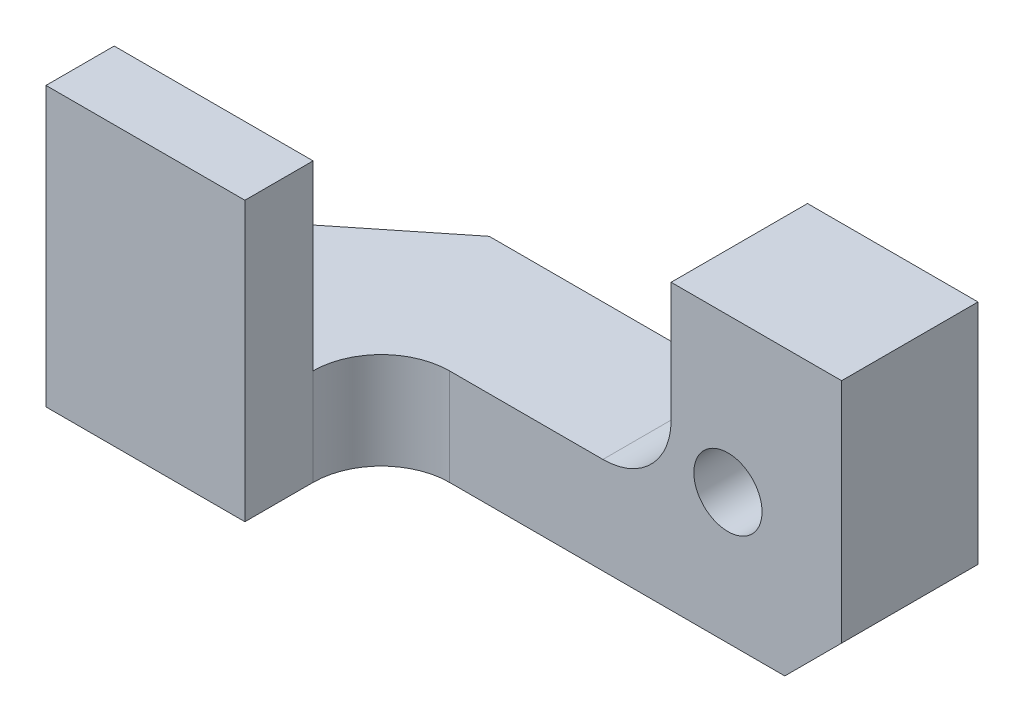
ISO-10303-21;
HEADER;
FILE_DESCRIPTION(('STEP AP214'),'2;1');
FILE_NAME('part.step','',(''),(''),'','','');
FILE_SCHEMA(('AUTOMOTIVE_DESIGN { 1 0 10303 214 1 1 1 1 }'));
ENDSEC;
DATA;
#1=APPLICATION_CONTEXT('core data for automotive mechanical design processes');
#2=APPLICATION_PROTOCOL_DEFINITION('international standard','automotive_design',2000,#1);
#3=PRODUCT_CONTEXT('',#1,'mechanical');
#4=PRODUCT('Part','Part','',(#3));
#5=PRODUCT_RELATED_PRODUCT_CATEGORY('part','',(#4));
#6=PRODUCT_DEFINITION_FORMATION('','',#4);
#7=PRODUCT_DEFINITION_CONTEXT('part definition',#1,'design');
#8=PRODUCT_DEFINITION('design','',#6,#7);
#9=PRODUCT_DEFINITION_SHAPE('','',#8);
#10=(LENGTH_UNIT() NAMED_UNIT(*) SI_UNIT(.MILLI.,.METRE.));
#11=(NAMED_UNIT(*) PLANE_ANGLE_UNIT() SI_UNIT($,.RADIAN.));
#12=(NAMED_UNIT(*) SI_UNIT($,.STERADIAN.) SOLID_ANGLE_UNIT());
#13=UNCERTAINTY_MEASURE_WITH_UNIT(LENGTH_MEASURE(1.E-05),#10,'distance_accuracy_value','');
#14=(GEOMETRIC_REPRESENTATION_CONTEXT(3) GLOBAL_UNCERTAINTY_ASSIGNED_CONTEXT((#13)) GLOBAL_UNIT_ASSIGNED_CONTEXT((#10,
#11,#12)) REPRESENTATION_CONTEXT('',''));
#15=CARTESIAN_POINT('',(0.,0.,0.));
#16=DIRECTION('',(0.,0.,1.));
#17=DIRECTION('',(1.,0.,0.));
#18=AXIS2_PLACEMENT_3D('',#15,#16,#17);
#19=CARTESIAN_POINT('',(7.366,6.35,-3.048));
#20=DIRECTION('',(0.,0.,1.));
#21=DIRECTION('',(1.,0.,0.));
#22=AXIS2_PLACEMENT_3D('',#19,#20,#21);
#23=PLANE('',#22);
#24=CARTESIAN_POINT('',(4.826,2.921,-3.048));
#25=DIRECTION('',(0.,0.,-1.));
#26=DIRECTION('',(-1.,0.,0.));
#27=AXIS2_PLACEMENT_3D('',#24,#25,#26);
#28=CIRCLE('',#27,0.761999999999999);
#29=CARTESIAN_POINT('',(4.064,2.921,-3.048));
#30=VERTEX_POINT('',#29);
#31=EDGE_CURVE('E158',#30,#30,#28,.T.);
#32=ORIENTED_EDGE('',*,*,#31,.F.);
#33=EDGE_LOOP('',(#32));
#34=FACE_BOUND('',#33,.T.);
#35=DIRECTION('',(0.,1.,0.));
#36=VECTOR('',#35,1.);
#37=CARTESIAN_POINT('',(-3.556,0.,-3.048));
#38=LINE('',#37,#36);
#39=CARTESIAN_POINT('',(-3.556,0.,-3.048));
#40=VERTEX_POINT('',#39);
#41=CARTESIAN_POINT('',(-3.556,2.159,-3.048));
#42=VERTEX_POINT('',#41);
#43=EDGE_CURVE('E189',#40,#42,#38,.T.);
#44=ORIENTED_EDGE('',*,*,#43,.T.);
#45=DIRECTION('',(1.,0.,0.));
#46=VECTOR('',#45,1.);
#47=CARTESIAN_POINT('',(0.,2.159,-3.048));
#48=LINE('',#47,#46);
#49=CARTESIAN_POINT('',(2.032,2.159,-3.048));
#50=VERTEX_POINT('',#49);
#51=EDGE_CURVE('E163',#42,#50,#48,.T.);
#52=ORIENTED_EDGE('',*,*,#51,.T.);
#53=CARTESIAN_POINT('',(2.032,3.683,-3.048));
#54=DIRECTION('',(0.,0.,-1.));
#55=DIRECTION('',(-1.,0.,0.));
#56=AXIS2_PLACEMENT_3D('',#53,#54,#55);
#57=CIRCLE('',#56,1.524);
#58=CARTESIAN_POINT('',(3.556,3.683,-3.048));
#59=VERTEX_POINT('',#58);
#60=EDGE_CURVE('E152',#59,#50,#57,.T.);
#61=ORIENTED_EDGE('',*,*,#60,.F.);
#62=DIRECTION('',(0.,1.,0.));
#63=VECTOR('',#62,1.);
#64=CARTESIAN_POINT('',(3.556,3.683,-3.048));
#65=LINE('',#64,#63);
#66=CARTESIAN_POINT('',(3.556,6.35,-3.048));
#67=VERTEX_POINT('',#66);
#68=EDGE_CURVE('E197',#59,#67,#65,.T.);
#69=ORIENTED_EDGE('',*,*,#68,.T.);
#70=DIRECTION('',(-1.,0.,0.));
#71=VECTOR('',#70,1.);
#72=CARTESIAN_POINT('',(7.366,6.35,-3.048));
#73=LINE('',#72,#71);
#74=CARTESIAN_POINT('',(7.366,6.35,-3.048));
#75=VERTEX_POINT('',#74);
#76=EDGE_CURVE('E222',#75,#67,#73,.T.);
#77=ORIENTED_EDGE('',*,*,#76,.F.);
#78=DIRECTION('',(0.,-1.,0.));
#79=VECTOR('',#78,1.);
#80=CARTESIAN_POINT('',(7.366,6.35,-3.048));
#81=LINE('',#80,#79);
#82=CARTESIAN_POINT('',(7.366,1.27,-3.048));
#83=VERTEX_POINT('',#82);
#84=EDGE_CURVE('E226',#75,#83,#81,.T.);
#85=ORIENTED_EDGE('',*,*,#84,.T.);
#86=DIRECTION('',(0.707106781186548,0.707106781186547,0.));
#87=VECTOR('',#86,1.);
#88=CARTESIAN_POINT('',(7.366,1.27,-3.048));
#89=LINE('',#88,#87);
#90=CARTESIAN_POINT('',(6.096,0.,-3.048));
#91=VERTEX_POINT('',#90);
#92=EDGE_CURVE('E173',#91,#83,#89,.T.);
#93=ORIENTED_EDGE('',*,*,#92,.F.);
#94=DIRECTION('',(-1.,0.,0.));
#95=VECTOR('',#94,1.);
#96=CARTESIAN_POINT('',(7.366,0.,-3.048));
#97=LINE('',#96,#95);
#98=EDGE_CURVE('E223',#91,#40,#97,.T.);
#99=ORIENTED_EDGE('',*,*,#98,.T.);
#100=EDGE_LOOP('',(#44,#52,#61,#69,#77,#85,#93,#99));
#101=FACE_BOUND('',#100,.T.);
#102=ADVANCED_FACE('F34',(#34,#101),#23,.F.);
#103=CARTESIAN_POINT('',(-1.397,0.,1.524));
#104=DIRECTION('',(0.,1.,0.));
#105=DIRECTION('',(0.,0.,1.));
#106=AXIS2_PLACEMENT_3D('',#103,#104,#105);
#107=CYLINDRICAL_SURFACE('',#106,1.524);
#108=CARTESIAN_POINT('',(-1.397,2.159,1.524));
#109=DIRECTION('',(0.,1.,0.));
#110=DIRECTION('',(-1.,0.,0.));
#111=AXIS2_PLACEMENT_3D('',#108,#109,#110);
#112=CIRCLE('',#111,1.524);
#113=CARTESIAN_POINT('',(-2.921,2.159,1.524));
#114=VERTEX_POINT('',#113);
#115=CARTESIAN_POINT('',(-1.397,2.159,0.));
#116=VERTEX_POINT('',#115);
#117=EDGE_CURVE('E171',#114,#116,#112,.F.);
#118=ORIENTED_EDGE('',*,*,#117,.F.);
#119=DIRECTION('',(0.,1.,0.));
#120=VECTOR('',#119,1.);
#121=CARTESIAN_POINT('',(-2.921,0.,1.524));
#122=LINE('',#121,#120);
#123=CARTESIAN_POINT('',(-2.921,0.,1.524));
#124=VERTEX_POINT('',#123);
#125=EDGE_CURVE('E58',#124,#114,#122,.T.);
#126=ORIENTED_EDGE('',*,*,#125,.F.);
#127=CARTESIAN_POINT('',(-1.397,0.,1.524));
#128=DIRECTION('',(0.,1.,0.));
#129=DIRECTION('',(0.,0.,1.));
#130=AXIS2_PLACEMENT_3D('',#127,#128,#129);
#131=CIRCLE('',#130,1.524);
#132=CARTESIAN_POINT('',(-1.397,0.,0.));
#133=VERTEX_POINT('',#132);
#134=EDGE_CURVE('E204',#133,#124,#131,.T.);
#135=ORIENTED_EDGE('',*,*,#134,.F.);
#136=DIRECTION('',(0.,1.,0.));
#137=VECTOR('',#136,1.);
#138=CARTESIAN_POINT('',(-1.397,0.,0.));
#139=LINE('',#138,#137);
#140=EDGE_CURVE('E209',#133,#116,#139,.T.);
#141=ORIENTED_EDGE('',*,*,#140,.T.);
#142=EDGE_LOOP('',(#118,#126,#135,#141));
#143=FACE_BOUND('',#142,.T.);
#144=ADVANCED_FACE('F283',(#143),#107,.F.);
#145=CARTESIAN_POINT('',(0.,0.,0.));
#146=DIRECTION('',(0.,0.,-1.));
#147=DIRECTION('',(-1.,0.,0.));
#148=AXIS2_PLACEMENT_3D('',#145,#146,#147);
#149=PLANE('',#148);
#150=CARTESIAN_POINT('',(4.826,2.921,0.));
#151=DIRECTION('',(0.,0.,-1.));
#152=DIRECTION('',(-1.,0.,0.));
#153=AXIS2_PLACEMENT_3D('',#150,#151,#152);
#154=CIRCLE('',#153,0.761999999999999);
#155=CARTESIAN_POINT('',(4.064,2.921,0.));
#156=VERTEX_POINT('',#155);
#157=EDGE_CURVE('E38',#156,#156,#154,.T.);
#158=ORIENTED_EDGE('',*,*,#157,.T.);
#159=EDGE_LOOP('',(#158));
#160=FACE_BOUND('',#159,.T.);
#161=DIRECTION('',(1.,0.,0.));
#162=VECTOR('',#161,1.);
#163=CARTESIAN_POINT('',(0.,2.159,0.));
#164=LINE('',#163,#162);
#165=CARTESIAN_POINT('',(2.032,2.159,0.));
#166=VERTEX_POINT('',#165);
#167=EDGE_CURVE('E43',#116,#166,#164,.T.);
#168=ORIENTED_EDGE('',*,*,#167,.F.);
#169=ORIENTED_EDGE('',*,*,#140,.F.);
#170=DIRECTION('',(-1.,0.,0.));
#171=VECTOR('',#170,1.);
#172=CARTESIAN_POINT('',(0.,0.,0.));
#173=LINE('',#172,#171);
#174=CARTESIAN_POINT('',(6.096,0.,0.));
#175=VERTEX_POINT('',#174);
#176=EDGE_CURVE('E202',#175,#133,#173,.T.);
#177=ORIENTED_EDGE('',*,*,#176,.F.);
#178=DIRECTION('',(0.707106781186548,0.707106781186547,0.));
#179=VECTOR('',#178,1.);
#180=CARTESIAN_POINT('',(3.048,-3.048,0.));
#181=LINE('',#180,#179);
#182=CARTESIAN_POINT('',(7.366,1.27,0.));
#183=VERTEX_POINT('',#182);
#184=EDGE_CURVE('E240',#175,#183,#181,.T.);
#185=ORIENTED_EDGE('',*,*,#184,.T.);
#186=DIRECTION('',(0.,1.,0.));
#187=VECTOR('',#186,1.);
#188=CARTESIAN_POINT('',(7.366,0.,0.));
#189=LINE('',#188,#187);
#190=CARTESIAN_POINT('',(7.366,6.35,0.));
#191=VERTEX_POINT('',#190);
#192=EDGE_CURVE('E212',#183,#191,#189,.T.);
#193=ORIENTED_EDGE('',*,*,#192,.T.);
#194=DIRECTION('',(-1.,0.,0.));
#195=VECTOR('',#194,1.);
#196=CARTESIAN_POINT('',(0.,6.35,0.));
#197=LINE('',#196,#195);
#198=CARTESIAN_POINT('',(3.556,6.35,0.));
#199=VERTEX_POINT('',#198);
#200=EDGE_CURVE('E201',#191,#199,#197,.T.);
#201=ORIENTED_EDGE('',*,*,#200,.T.);
#202=DIRECTION('',(0.,-1.,0.));
#203=VECTOR('',#202,1.);
#204=CARTESIAN_POINT('',(3.556,0.,0.));
#205=LINE('',#204,#203);
#206=CARTESIAN_POINT('',(3.556,3.683,0.));
#207=VERTEX_POINT('',#206);
#208=EDGE_CURVE('E237',#199,#207,#205,.T.);
#209=ORIENTED_EDGE('',*,*,#208,.T.);
#210=CARTESIAN_POINT('',(2.032,3.683,0.));
#211=DIRECTION('',(0.,0.,-1.));
#212=DIRECTION('',(-1.,0.,0.));
#213=AXIS2_PLACEMENT_3D('',#210,#211,#212);
#214=CIRCLE('',#213,1.524);
#215=EDGE_CURVE('E168',#207,#166,#214,.T.);
#216=ORIENTED_EDGE('',*,*,#215,.T.);
#217=EDGE_LOOP('',(#168,#169,#177,#185,#193,#201,#209,#216));
#218=FACE_BOUND('',#217,.T.);
#219=ADVANCED_FACE('F250',(#160,#218),#149,.F.);
#220=CARTESIAN_POINT('',(-7.366,6.35,3.048));
#221=DIRECTION('',(1.,0.,0.));
#222=DIRECTION('',(0.,0.,-1.));
#223=AXIS2_PLACEMENT_3D('',#220,#221,#222);
#224=PLANE('',#223);
#225=DIRECTION('',(0.,-1.,0.));
#226=VECTOR('',#225,1.);
#227=CARTESIAN_POINT('',(-7.366,6.223,1.524));
#228=LINE('',#227,#226);
#229=CARTESIAN_POINT('',(-7.366,6.223,1.524));
#230=VERTEX_POINT('',#229);
#231=CARTESIAN_POINT('',(-7.366,2.159,1.524));
#232=VERTEX_POINT('',#231);
#233=EDGE_CURVE('E135',#230,#232,#228,.T.);
#234=ORIENTED_EDGE('',*,*,#233,.T.);
#235=DIRECTION('',(0.,0.,-1.));
#236=VECTOR('',#235,1.);
#237=CARTESIAN_POINT('',(-7.366,2.159,1.524));
#238=LINE('',#237,#236);
#239=CARTESIAN_POINT('',(-7.366,2.159,0.));
#240=VERTEX_POINT('',#239);
#241=EDGE_CURVE('E138',#232,#240,#238,.T.);
#242=ORIENTED_EDGE('',*,*,#241,.T.);
#243=DIRECTION('',(0.,1.,0.));
#244=VECTOR('',#243,1.);
#245=CARTESIAN_POINT('',(-7.366,0.,0.));
#246=LINE('',#245,#244);
#247=CARTESIAN_POINT('',(-7.366,0.,0.));
#248=VERTEX_POINT('',#247);
#249=EDGE_CURVE('E190',#248,#240,#246,.T.);
#250=ORIENTED_EDGE('',*,*,#249,.F.);
#251=DIRECTION('',(0.,0.,1.));
#252=VECTOR('',#251,1.);
#253=CARTESIAN_POINT('',(-7.366,0.,3.048));
#254=LINE('',#253,#252);
#255=CARTESIAN_POINT('',(-7.366,0.,3.048));
#256=VERTEX_POINT('',#255);
#257=EDGE_CURVE('E214',#248,#256,#254,.T.);
#258=ORIENTED_EDGE('',*,*,#257,.T.);
#259=DIRECTION('',(0.,-1.,0.));
#260=VECTOR('',#259,1.);
#261=CARTESIAN_POINT('',(-7.366,6.35,3.048));
#262=LINE('',#261,#260);
#263=CARTESIAN_POINT('',(-7.366,6.223,3.048));
#264=VERTEX_POINT('',#263);
#265=EDGE_CURVE('E234',#264,#256,#262,.T.);
#266=ORIENTED_EDGE('',*,*,#265,.F.);
#267=DIRECTION('',(0.,0.,1.));
#268=VECTOR('',#267,1.);
#269=CARTESIAN_POINT('',(-7.366,6.223,3.048));
#270=LINE('',#269,#268);
#271=EDGE_CURVE('E141',#230,#264,#270,.T.);
#272=ORIENTED_EDGE('',*,*,#271,.F.);
#273=EDGE_LOOP('',(#234,#242,#250,#258,#266,#272));
#274=FACE_BOUND('',#273,.T.);
#275=ADVANCED_FACE('F36',(#274),#224,.F.);
#276=CARTESIAN_POINT('',(0.,0.,0.));
#277=DIRECTION('',(0.,1.,0.));
#278=DIRECTION('',(0.,0.,1.));
#279=AXIS2_PLACEMENT_3D('',#276,#277,#278);
#280=PLANE('',#279);
#281=ORIENTED_EDGE('',*,*,#98,.F.);
#282=DIRECTION('',(0.,0.,-1.));
#283=VECTOR('',#282,1.);
#284=CARTESIAN_POINT('',(6.096,0.,3.048));
#285=LINE('',#284,#283);
#286=EDGE_CURVE('E175',#175,#91,#285,.T.);
#287=ORIENTED_EDGE('',*,*,#286,.F.);
#288=ORIENTED_EDGE('',*,*,#176,.T.);
#289=ORIENTED_EDGE('',*,*,#134,.T.);
#290=DIRECTION('',(0.,0.,-1.));
#291=VECTOR('',#290,1.);
#292=CARTESIAN_POINT('',(-2.921,0.,0.));
#293=LINE('',#292,#291);
#294=CARTESIAN_POINT('',(-2.921,0.,3.048));
#295=VERTEX_POINT('',#294);
#296=EDGE_CURVE('E207',#295,#124,#293,.T.);
#297=ORIENTED_EDGE('',*,*,#296,.F.);
#298=DIRECTION('',(1.,0.,0.));
#299=VECTOR('',#298,1.);
#300=CARTESIAN_POINT('',(7.366,0.,3.048));
#301=LINE('',#300,#299);
#302=EDGE_CURVE('E228',#256,#295,#301,.T.);
#303=ORIENTED_EDGE('',*,*,#302,.F.);
#304=ORIENTED_EDGE('',*,*,#257,.F.);
#305=DIRECTION('',(-0.78086880944303,0.,0.624695047554424));
#306=VECTOR('',#305,1.);
#307=CARTESIAN_POINT('',(-2.87453658536585,0.,-3.59317073170732));
#308=LINE('',#307,#306);
#309=EDGE_CURVE('E187',#40,#248,#308,.T.);
#310=ORIENTED_EDGE('',*,*,#309,.F.);
#311=EDGE_LOOP('',(#281,#287,#288,#289,#297,#303,#304,#310));
#312=FACE_BOUND('',#311,.T.);
#313=ADVANCED_FACE('F271',(#312),#280,.F.);
#314=CARTESIAN_POINT('',(7.366,6.35,3.048));
#315=DIRECTION('',(0.,0.,-1.));
#316=DIRECTION('',(-1.,0.,0.));
#317=AXIS2_PLACEMENT_3D('',#314,#315,#316);
#318=PLANE('',#317);
#319=DIRECTION('',(0.,1.,0.));
#320=VECTOR('',#319,1.);
#321=CARTESIAN_POINT('',(-2.921,0.,3.048));
#322=LINE('',#321,#320);
#323=CARTESIAN_POINT('',(-2.921,6.223,3.048));
#324=VERTEX_POINT('',#323);
#325=EDGE_CURVE('E215',#295,#324,#322,.T.);
#326=ORIENTED_EDGE('',*,*,#325,.T.);
#327=DIRECTION('',(1.,0.,0.));
#328=VECTOR('',#327,1.);
#329=CARTESIAN_POINT('',(-2.921,6.223,3.048));
#330=LINE('',#329,#328);
#331=EDGE_CURVE('E145',#264,#324,#330,.T.);
#332=ORIENTED_EDGE('',*,*,#331,.F.);
#333=ORIENTED_EDGE('',*,*,#265,.T.);
#334=ORIENTED_EDGE('',*,*,#302,.T.);
#335=EDGE_LOOP('',(#326,#332,#333,#334));
#336=FACE_BOUND('',#335,.T.);
#337=ADVANCED_FACE('F274',(#336),#318,.F.);
#338=CARTESIAN_POINT('',(-2.921,0.,0.));
#339=DIRECTION('',(1.,0.,0.));
#340=DIRECTION('',(0.,0.,-1.));
#341=AXIS2_PLACEMENT_3D('',#338,#339,#340);
#342=PLANE('',#341);
#343=ORIENTED_EDGE('',*,*,#125,.T.);
#344=DIRECTION('',(0.,-1.,0.));
#345=VECTOR('',#344,1.);
#346=CARTESIAN_POINT('',(-2.921,6.223,1.524));
#347=LINE('',#346,#345);
#348=CARTESIAN_POINT('',(-2.921,6.223,1.524));
#349=VERTEX_POINT('',#348);
#350=EDGE_CURVE('E144',#349,#114,#347,.T.);
#351=ORIENTED_EDGE('',*,*,#350,.F.);
#352=DIRECTION('',(0.,0.,-1.));
#353=VECTOR('',#352,1.);
#354=CARTESIAN_POINT('',(-2.921,6.223,3.048));
#355=LINE('',#354,#353);
#356=EDGE_CURVE('E177',#324,#349,#355,.T.);
#357=ORIENTED_EDGE('',*,*,#356,.F.);
#358=ORIENTED_EDGE('',*,*,#325,.F.);
#359=ORIENTED_EDGE('',*,*,#296,.T.);
#360=EDGE_LOOP('',(#343,#351,#357,#358,#359));
#361=FACE_BOUND('',#360,.T.);
#362=ADVANCED_FACE('F280',(#361),#342,.T.);
#363=CARTESIAN_POINT('',(7.366,6.35,3.048));
#364=DIRECTION('',(-1.,0.,0.));
#365=DIRECTION('',(0.,0.,1.));
#366=AXIS2_PLACEMENT_3D('',#363,#364,#365);
#367=PLANE('',#366);
#368=ORIENTED_EDGE('',*,*,#192,.F.);
#369=DIRECTION('',(0.,0.,-1.));
#370=VECTOR('',#369,1.);
#371=CARTESIAN_POINT('',(7.366,1.27,3.048));
#372=LINE('',#371,#370);
#373=EDGE_CURVE('E50',#183,#83,#372,.T.);
#374=ORIENTED_EDGE('',*,*,#373,.T.);
#375=ORIENTED_EDGE('',*,*,#84,.F.);
#376=DIRECTION('',(0.,0.,-1.));
#377=VECTOR('',#376,1.);
#378=CARTESIAN_POINT('',(7.366,6.35,3.048));
#379=LINE('',#378,#377);
#380=EDGE_CURVE('E220',#191,#75,#379,.T.);
#381=ORIENTED_EDGE('',*,*,#380,.F.);
#382=EDGE_LOOP('',(#368,#374,#375,#381));
#383=FACE_BOUND('',#382,.T.);
#384=ADVANCED_FACE('F286',(#383),#367,.F.);
#385=CARTESIAN_POINT('',(0.,6.35,0.));
#386=DIRECTION('',(0.,1.,0.));
#387=DIRECTION('',(0.,0.,1.));
#388=AXIS2_PLACEMENT_3D('',#385,#386,#387);
#389=PLANE('',#388);
#390=DIRECTION('',(0.,0.,-1.));
#391=VECTOR('',#390,1.);
#392=CARTESIAN_POINT('',(3.556,6.35,-3.048));
#393=LINE('',#392,#391);
#394=EDGE_CURVE('E192',#199,#67,#393,.T.);
#395=ORIENTED_EDGE('',*,*,#394,.F.);
#396=ORIENTED_EDGE('',*,*,#200,.F.);
#397=ORIENTED_EDGE('',*,*,#380,.T.);
#398=ORIENTED_EDGE('',*,*,#76,.T.);
#399=EDGE_LOOP('',(#395,#396,#397,#398));
#400=FACE_BOUND('',#399,.T.);
#401=ADVANCED_FACE('F257',(#400),#389,.T.);
#402=CARTESIAN_POINT('',(3.556,3.683,-3.048));
#403=DIRECTION('',(1.,0.,0.));
#404=DIRECTION('',(0.,0.,-1.));
#405=AXIS2_PLACEMENT_3D('',#402,#403,#404);
#406=PLANE('',#405);
#407=ORIENTED_EDGE('',*,*,#394,.T.);
#408=ORIENTED_EDGE('',*,*,#68,.F.);
#409=DIRECTION('',(0.,0.,-1.));
#410=VECTOR('',#409,1.);
#411=CARTESIAN_POINT('',(3.556,3.683,-3.048));
#412=LINE('',#411,#410);
#413=EDGE_CURVE('E195',#207,#59,#412,.T.);
#414=ORIENTED_EDGE('',*,*,#413,.F.);
#415=ORIENTED_EDGE('',*,*,#208,.F.);
#416=EDGE_LOOP('',(#407,#408,#414,#415));
#417=FACE_BOUND('',#416,.T.);
#418=ADVANCED_FACE('F254',(#417),#406,.F.);
#419=CARTESIAN_POINT('',(-2.87453658536585,0.,-3.59317073170732));
#420=DIRECTION('',(-0.624695047554424,0.,-0.78086880944303));
#421=DIRECTION('',(-0.78086880944303,0.,0.624695047554424));
#422=AXIS2_PLACEMENT_3D('',#419,#420,#421);
#423=PLANE('',#422);
#424=DIRECTION('',(-0.78086880944303,0.,0.624695047554424));
#425=VECTOR('',#424,1.);
#426=CARTESIAN_POINT('',(-2.87453658536585,2.159,-3.59317073170732));
#427=LINE('',#426,#425);
#428=EDGE_CURVE('E11',#42,#240,#427,.T.);
#429=ORIENTED_EDGE('',*,*,#428,.F.);
#430=ORIENTED_EDGE('',*,*,#43,.F.);
#431=ORIENTED_EDGE('',*,*,#309,.T.);
#432=ORIENTED_EDGE('',*,*,#249,.T.);
#433=EDGE_LOOP('',(#429,#430,#431,#432));
#434=FACE_BOUND('',#433,.T.);
#435=ADVANCED_FACE('F265',(#434),#423,.T.);
#436=CARTESIAN_POINT('',(-2.921,6.223,1.524));
#437=DIRECTION('',(0.,0.,1.));
#438=DIRECTION('',(1.,0.,0.));
#439=AXIS2_PLACEMENT_3D('',#436,#437,#438);
#440=PLANE('',#439);
#441=ORIENTED_EDGE('',*,*,#350,.T.);
#442=DIRECTION('',(-1.,0.,0.));
#443=VECTOR('',#442,1.);
#444=CARTESIAN_POINT('',(-2.921,2.159,1.524));
#445=LINE('',#444,#443);
#446=EDGE_CURVE('E150',#114,#232,#445,.T.);
#447=ORIENTED_EDGE('',*,*,#446,.T.);
#448=ORIENTED_EDGE('',*,*,#233,.F.);
#449=DIRECTION('',(-1.,0.,0.));
#450=VECTOR('',#449,1.);
#451=CARTESIAN_POINT('',(-2.921,6.223,1.524));
#452=LINE('',#451,#450);
#453=EDGE_CURVE('E181',#349,#230,#452,.T.);
#454=ORIENTED_EDGE('',*,*,#453,.F.);
#455=EDGE_LOOP('',(#441,#447,#448,#454));
#456=FACE_BOUND('',#455,.T.);
#457=ADVANCED_FACE('F154',(#456),#440,.F.);
#458=CARTESIAN_POINT('',(0.,6.223,0.));
#459=DIRECTION('',(0.,1.,0.));
#460=DIRECTION('',(0.,0.,1.));
#461=AXIS2_PLACEMENT_3D('',#458,#459,#460);
#462=PLANE('',#461);
#463=ORIENTED_EDGE('',*,*,#356,.T.);
#464=ORIENTED_EDGE('',*,*,#453,.T.);
#465=ORIENTED_EDGE('',*,*,#271,.T.);
#466=ORIENTED_EDGE('',*,*,#331,.T.);
#467=EDGE_LOOP('',(#463,#464,#465,#466));
#468=FACE_BOUND('',#467,.T.);
#469=ADVANCED_FACE('F277',(#468),#462,.T.);
#470=CARTESIAN_POINT('',(7.366,1.27,3.048));
#471=DIRECTION('',(-0.707106781186547,0.707106781186548,0.));
#472=DIRECTION('',(-0.707106781186548,-0.707106781186547,0.));
#473=AXIS2_PLACEMENT_3D('',#470,#471,#472);
#474=PLANE('',#473);
#475=ORIENTED_EDGE('',*,*,#286,.T.);
#476=ORIENTED_EDGE('',*,*,#92,.T.);
#477=ORIENTED_EDGE('',*,*,#373,.F.);
#478=ORIENTED_EDGE('',*,*,#184,.F.);
#479=EDGE_LOOP('',(#475,#476,#477,#478));
#480=FACE_BOUND('',#479,.T.);
#481=ADVANCED_FACE('F317',(#480),#474,.F.);
#482=CARTESIAN_POINT('',(0.,2.159,1.143));
#483=DIRECTION('',(0.,1.,0.));
#484=DIRECTION('',(-1.,0.,0.));
#485=AXIS2_PLACEMENT_3D('',#482,#483,#484);
#486=PLANE('',#485);
#487=ORIENTED_EDGE('',*,*,#117,.T.);
#488=ORIENTED_EDGE('',*,*,#167,.T.);
#489=DIRECTION('',(0.,0.,-1.));
#490=VECTOR('',#489,1.);
#491=CARTESIAN_POINT('',(2.032,2.159,1.143));
#492=LINE('',#491,#490);
#493=EDGE_CURVE('E166',#166,#50,#492,.T.);
#494=ORIENTED_EDGE('',*,*,#493,.T.);
#495=ORIENTED_EDGE('',*,*,#51,.F.);
#496=ORIENTED_EDGE('',*,*,#428,.T.);
#497=ORIENTED_EDGE('',*,*,#241,.F.);
#498=ORIENTED_EDGE('',*,*,#446,.F.);
#499=EDGE_LOOP('',(#487,#488,#494,#495,#496,#497,#498));
#500=FACE_BOUND('',#499,.T.);
#501=ADVANCED_FACE('F149',(#500),#486,.T.);
#502=CARTESIAN_POINT('',(2.032,3.683,1.143));
#503=DIRECTION('',(0.,0.,-1.));
#504=DIRECTION('',(-1.,0.,0.));
#505=AXIS2_PLACEMENT_3D('',#502,#503,#504);
#506=CYLINDRICAL_SURFACE('',#505,1.524);
#507=ORIENTED_EDGE('',*,*,#413,.T.);
#508=ORIENTED_EDGE('',*,*,#60,.T.);
#509=ORIENTED_EDGE('',*,*,#493,.F.);
#510=ORIENTED_EDGE('',*,*,#215,.F.);
#511=EDGE_LOOP('',(#507,#508,#509,#510));
#512=FACE_BOUND('',#511,.T.);
#513=ADVANCED_FACE('F247',(#512),#506,.F.);
#514=CARTESIAN_POINT('',(4.826,2.921,1.524));
#515=DIRECTION('',(0.,0.,-1.));
#516=DIRECTION('',(-1.,0.,0.));
#517=AXIS2_PLACEMENT_3D('',#514,#515,#516);
#518=CYLINDRICAL_SURFACE('',#517,0.761999999999999);
#519=ORIENTED_EDGE('',*,*,#31,.T.);
#520=EDGE_LOOP('',(#519));
#521=FACE_BOUND('',#520,.T.);
#522=ORIENTED_EDGE('',*,*,#157,.F.);
#523=EDGE_LOOP('',(#522));
#524=FACE_BOUND('',#523,.T.);
#525=ADVANCED_FACE('F322',(#521,#524),#518,.F.);
#526=CLOSED_SHELL('',(#102,#144,#219,#275,#313,#337,#362,#384,#401,#418,#435,#457,#469,#481,
#501,#513,#525));
#527=MANIFOLD_SOLID_BREP('B2',#526);
#528=ADVANCED_BREP_SHAPE_REPRESENTATION('',(#18,#527),#14);
#529=SHAPE_DEFINITION_REPRESENTATION(#9,#528);
ENDSEC;
END-ISO-10303-21;
